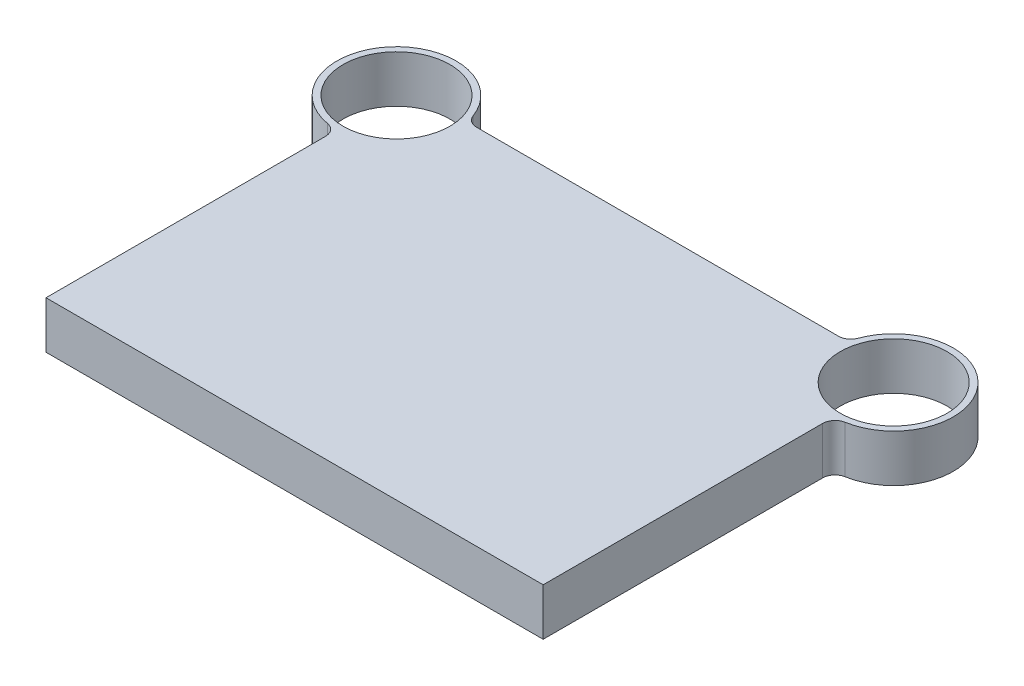
ISO-10303-21;
HEADER;
FILE_DESCRIPTION(('STEP AP214'),'2;1');
FILE_NAME('part.step','',(''),(''),'','','');
FILE_SCHEMA(('AUTOMOTIVE_DESIGN { 1 0 10303 214 1 1 1 1 }'));
ENDSEC;
DATA;
#1=APPLICATION_CONTEXT('core data for automotive mechanical design processes');
#2=APPLICATION_PROTOCOL_DEFINITION('international standard','automotive_design',2000,#1);
#3=PRODUCT_CONTEXT('',#1,'mechanical');
#4=PRODUCT('Part','Part','',(#3));
#5=PRODUCT_RELATED_PRODUCT_CATEGORY('part','',(#4));
#6=PRODUCT_DEFINITION_FORMATION('','',#4);
#7=PRODUCT_DEFINITION_CONTEXT('part definition',#1,'design');
#8=PRODUCT_DEFINITION('design','',#6,#7);
#9=PRODUCT_DEFINITION_SHAPE('','',#8);
#10=(LENGTH_UNIT() NAMED_UNIT(*) SI_UNIT(.MILLI.,.METRE.));
#11=(NAMED_UNIT(*) PLANE_ANGLE_UNIT() SI_UNIT($,.RADIAN.));
#12=(NAMED_UNIT(*) SI_UNIT($,.STERADIAN.) SOLID_ANGLE_UNIT());
#13=UNCERTAINTY_MEASURE_WITH_UNIT(LENGTH_MEASURE(1.E-05),#10,'distance_accuracy_value','');
#14=(GEOMETRIC_REPRESENTATION_CONTEXT(3) GLOBAL_UNCERTAINTY_ASSIGNED_CONTEXT((#13)) GLOBAL_UNIT_ASSIGNED_CONTEXT((#10,
#11,#12)) REPRESENTATION_CONTEXT('',''));
#15=CARTESIAN_POINT('',(0.,0.,0.));
#16=DIRECTION('',(0.,0.,1.));
#17=DIRECTION('',(1.,0.,0.));
#18=AXIS2_PLACEMENT_3D('',#15,#16,#17);
#19=CARTESIAN_POINT('',(-200.,38.,-282.));
#20=DIRECTION('',(0.,1.,0.));
#21=DIRECTION('',(0.,0.,1.));
#22=AXIS2_PLACEMENT_3D('',#19,#20,#21);
#23=PLANE('',#22);
#24=CARTESIAN_POINT('',(-200.,38.,-282.));
#25=DIRECTION('',(0.,1.,0.));
#26=DIRECTION('',(0.,0.,1.));
#27=AXIS2_PLACEMENT_3D('',#24,#25,#26);
#28=CIRCLE('',#27,43.);
#29=CARTESIAN_POINT('',(-200.,38.,-239.));
#30=VERTEX_POINT('',#29);
#31=EDGE_CURVE('E240',#30,#30,#28,.T.);
#32=ORIENTED_EDGE('',*,*,#31,.F.);
#33=EDGE_LOOP('',(#32));
#34=FACE_BOUND('',#33,.T.);
#35=CARTESIAN_POINT('',(-200.,38.,-282.));
#36=DIRECTION('',(0.,1.,0.));
#37=DIRECTION('',(0.,0.,1.));
#38=AXIS2_PLACEMENT_3D('',#35,#36,#37);
#39=CIRCLE('',#38,48.);
#40=CARTESIAN_POINT('',(-154.944030050815,38.,-298.551724137931));
#41=VERTEX_POINT('',#40);
#42=CARTESIAN_POINT('',(-208.275862068965,38.,-234.718818679992));
#43=VERTEX_POINT('',#42);
#44=EDGE_CURVE('E133',#41,#43,#39,.T.);
#45=ORIENTED_EDGE('',*,*,#44,.T.);
#46=CARTESIAN_POINT('',(-210.,38.,-224.868572571657));
#47=DIRECTION('',(0.,1.,0.));
#48=DIRECTION('',(0.,0.,1.));
#49=AXIS2_PLACEMENT_3D('',#46,#47,#48);
#50=CIRCLE('',#49,10.);
#51=CARTESIAN_POINT('',(-200.,38.,-224.868572571657));
#52=VERTEX_POINT('',#51);
#53=EDGE_CURVE('E11',#43,#52,#50,.F.);
#54=ORIENTED_EDGE('',*,*,#53,.T.);
#55=DIRECTION('',(0.,0.,1.));
#56=VECTOR('',#55,1.);
#57=CARTESIAN_POINT('',(-200.,38.,0.));
#58=LINE('',#57,#56);
#59=CARTESIAN_POINT('',(-200.,38.,0.));
#60=VERTEX_POINT('',#59);
#61=EDGE_CURVE('E106',#52,#60,#58,.T.);
#62=ORIENTED_EDGE('',*,*,#61,.T.);
#63=DIRECTION('',(1.,0.,0.));
#64=VECTOR('',#63,1.);
#65=CARTESIAN_POINT('',(200.,38.,0.));
#66=LINE('',#65,#64);
#67=CARTESIAN_POINT('',(200.,38.,0.));
#68=VERTEX_POINT('',#67);
#69=EDGE_CURVE('E110',#60,#68,#66,.T.);
#70=ORIENTED_EDGE('',*,*,#69,.T.);
#71=DIRECTION('',(0.,0.,-1.));
#72=VECTOR('',#71,1.);
#73=CARTESIAN_POINT('',(200.,38.,0.));
#74=LINE('',#73,#72);
#75=CARTESIAN_POINT('',(200.,38.,-224.868572571657));
#76=VERTEX_POINT('',#75);
#77=EDGE_CURVE('E123',#68,#76,#74,.T.);
#78=ORIENTED_EDGE('',*,*,#77,.T.);
#79=CARTESIAN_POINT('',(210.,38.,-224.868572571657));
#80=DIRECTION('',(0.,1.,0.));
#81=DIRECTION('',(0.,0.,1.));
#82=AXIS2_PLACEMENT_3D('',#79,#80,#81);
#83=CIRCLE('',#82,10.);
#84=CARTESIAN_POINT('',(208.275862068965,38.,-234.718818679992));
#85=VERTEX_POINT('',#84);
#86=EDGE_CURVE('E155',#76,#85,#83,.F.);
#87=ORIENTED_EDGE('',*,*,#86,.T.);
#88=CARTESIAN_POINT('',(200.,38.,-282.));
#89=DIRECTION('',(0.,1.,0.));
#90=DIRECTION('',(0.,0.,-1.));
#91=AXIS2_PLACEMENT_3D('',#88,#89,#90);
#92=CIRCLE('',#91,48.);
#93=CARTESIAN_POINT('',(154.944030050815,38.,-298.551724137931));
#94=VERTEX_POINT('',#93);
#95=EDGE_CURVE('E229',#85,#94,#92,.T.);
#96=ORIENTED_EDGE('',*,*,#95,.T.);
#97=CARTESIAN_POINT('',(145.557369644735,38.,-302.));
#98=DIRECTION('',(0.,1.,0.));
#99=DIRECTION('',(0.,0.,1.));
#100=AXIS2_PLACEMENT_3D('',#97,#98,#99);
#101=CIRCLE('',#100,10.);
#102=CARTESIAN_POINT('',(145.557369644735,38.,-292.));
#103=VERTEX_POINT('',#102);
#104=EDGE_CURVE('E159',#94,#103,#101,.F.);
#105=ORIENTED_EDGE('',*,*,#104,.T.);
#106=DIRECTION('',(-1.,0.,0.));
#107=VECTOR('',#106,1.);
#108=CARTESIAN_POINT('',(153.053221622778,38.,-292.));
#109=LINE('',#108,#107);
#110=CARTESIAN_POINT('',(-145.557369644735,38.,-292.));
#111=VERTEX_POINT('',#110);
#112=EDGE_CURVE('E226',#103,#111,#109,.T.);
#113=ORIENTED_EDGE('',*,*,#112,.T.);
#114=CARTESIAN_POINT('',(-145.557369644735,38.,-302.));
#115=DIRECTION('',(0.,1.,0.));
#116=DIRECTION('',(0.,0.,1.));
#117=AXIS2_PLACEMENT_3D('',#114,#115,#116);
#118=CIRCLE('',#117,10.);
#119=EDGE_CURVE('E163',#111,#41,#118,.F.);
#120=ORIENTED_EDGE('',*,*,#119,.T.);
#121=EDGE_LOOP('',(#45,#54,#62,#70,#78,#87,#96,#105,#113,#120));
#122=FACE_BOUND('',#121,.T.);
#123=CARTESIAN_POINT('',(200.,38.,-282.));
#124=DIRECTION('',(0.,1.,0.));
#125=DIRECTION('',(0.,0.,-1.));
#126=AXIS2_PLACEMENT_3D('',#123,#124,#125);
#127=CIRCLE('',#126,43.);
#128=CARTESIAN_POINT('',(200.,38.,-325.));
#129=VERTEX_POINT('',#128);
#130=EDGE_CURVE('E257',#129,#129,#127,.T.);
#131=ORIENTED_EDGE('',*,*,#130,.F.);
#132=EDGE_LOOP('',(#131));
#133=FACE_BOUND('',#132,.T.);
#134=ADVANCED_FACE('F33',(#34,#122,#133),#23,.T.);
#135=CARTESIAN_POINT('',(-200.,0.,-282.));
#136=DIRECTION('',(0.,1.,0.));
#137=DIRECTION('',(0.,0.,1.));
#138=AXIS2_PLACEMENT_3D('',#135,#136,#137);
#139=PLANE('',#138);
#140=DIRECTION('',(0.,0.,1.));
#141=VECTOR('',#140,1.);
#142=CARTESIAN_POINT('',(-200.,0.,0.));
#143=LINE('',#142,#141);
#144=CARTESIAN_POINT('',(-200.,0.,-224.868572571657));
#145=VERTEX_POINT('',#144);
#146=CARTESIAN_POINT('',(-200.,0.,0.));
#147=VERTEX_POINT('',#146);
#148=EDGE_CURVE('E127',#145,#147,#143,.T.);
#149=ORIENTED_EDGE('',*,*,#148,.F.);
#150=CARTESIAN_POINT('',(-210.,0.,-224.868572571657));
#151=DIRECTION('',(0.,1.,0.));
#152=DIRECTION('',(0.,0.,1.));
#153=AXIS2_PLACEMENT_3D('',#150,#151,#152);
#154=CIRCLE('',#153,10.);
#155=CARTESIAN_POINT('',(-208.275862068965,0.,-234.718818679992));
#156=VERTEX_POINT('',#155);
#157=EDGE_CURVE('E41',#145,#156,#154,.T.);
#158=ORIENTED_EDGE('',*,*,#157,.T.);
#159=CARTESIAN_POINT('',(-200.,0.,-282.));
#160=DIRECTION('',(0.,1.,0.));
#161=DIRECTION('',(0.,0.,1.));
#162=AXIS2_PLACEMENT_3D('',#159,#160,#161);
#163=CIRCLE('',#162,48.);
#164=CARTESIAN_POINT('',(-154.944030050815,0.,-298.551724137931));
#165=VERTEX_POINT('',#164);
#166=EDGE_CURVE('E114',#165,#156,#163,.T.);
#167=ORIENTED_EDGE('',*,*,#166,.F.);
#168=CARTESIAN_POINT('',(-145.557369644735,0.,-302.));
#169=DIRECTION('',(0.,1.,0.));
#170=DIRECTION('',(0.,0.,1.));
#171=AXIS2_PLACEMENT_3D('',#168,#169,#170);
#172=CIRCLE('',#171,10.);
#173=CARTESIAN_POINT('',(-145.557369644735,0.,-292.));
#174=VERTEX_POINT('',#173);
#175=EDGE_CURVE('E161',#165,#174,#172,.T.);
#176=ORIENTED_EDGE('',*,*,#175,.T.);
#177=DIRECTION('',(-1.,0.,0.));
#178=VECTOR('',#177,1.);
#179=CARTESIAN_POINT('',(153.053221622778,0.,-292.));
#180=LINE('',#179,#178);
#181=CARTESIAN_POINT('',(145.557369644735,0.,-292.));
#182=VERTEX_POINT('',#181);
#183=EDGE_CURVE('E173',#182,#174,#180,.T.);
#184=ORIENTED_EDGE('',*,*,#183,.F.);
#185=CARTESIAN_POINT('',(145.557369644735,0.,-302.));
#186=DIRECTION('',(0.,1.,0.));
#187=DIRECTION('',(0.,0.,1.));
#188=AXIS2_PLACEMENT_3D('',#185,#186,#187);
#189=CIRCLE('',#188,10.);
#190=CARTESIAN_POINT('',(154.944030050815,0.,-298.551724137931));
#191=VERTEX_POINT('',#190);
#192=EDGE_CURVE('E157',#182,#191,#189,.T.);
#193=ORIENTED_EDGE('',*,*,#192,.T.);
#194=CARTESIAN_POINT('',(200.,0.,-282.));
#195=DIRECTION('',(0.,1.,0.));
#196=DIRECTION('',(0.,0.,-1.));
#197=AXIS2_PLACEMENT_3D('',#194,#195,#196);
#198=CIRCLE('',#197,48.);
#199=CARTESIAN_POINT('',(208.275862068965,0.,-234.718818679992));
#200=VERTEX_POINT('',#199);
#201=EDGE_CURVE('E245',#200,#191,#198,.T.);
#202=ORIENTED_EDGE('',*,*,#201,.F.);
#203=CARTESIAN_POINT('',(210.,0.,-224.868572571657));
#204=DIRECTION('',(0.,1.,0.));
#205=DIRECTION('',(0.,0.,1.));
#206=AXIS2_PLACEMENT_3D('',#203,#204,#205);
#207=CIRCLE('',#206,10.);
#208=CARTESIAN_POINT('',(200.,0.,-224.868572571657));
#209=VERTEX_POINT('',#208);
#210=EDGE_CURVE('E153',#200,#209,#207,.T.);
#211=ORIENTED_EDGE('',*,*,#210,.T.);
#212=DIRECTION('',(0.,0.,-1.));
#213=VECTOR('',#212,1.);
#214=CARTESIAN_POINT('',(200.,0.,0.));
#215=LINE('',#214,#213);
#216=CARTESIAN_POINT('',(200.,0.,0.));
#217=VERTEX_POINT('',#216);
#218=EDGE_CURVE('E242',#217,#209,#215,.T.);
#219=ORIENTED_EDGE('',*,*,#218,.F.);
#220=DIRECTION('',(1.,0.,0.));
#221=VECTOR('',#220,1.);
#222=CARTESIAN_POINT('',(200.,0.,0.));
#223=LINE('',#222,#221);
#224=EDGE_CURVE('E239',#147,#217,#223,.T.);
#225=ORIENTED_EDGE('',*,*,#224,.F.);
#226=EDGE_LOOP('',(#149,#158,#167,#176,#184,#193,#202,#211,#219,#225));
#227=FACE_BOUND('',#226,.T.);
#228=CARTESIAN_POINT('',(-200.,0.,-282.));
#229=DIRECTION('',(0.,1.,0.));
#230=DIRECTION('',(0.,0.,1.));
#231=AXIS2_PLACEMENT_3D('',#228,#229,#230);
#232=CIRCLE('',#231,43.);
#233=CARTESIAN_POINT('',(-200.,0.,-239.));
#234=VERTEX_POINT('',#233);
#235=EDGE_CURVE('E254',#234,#234,#232,.T.);
#236=ORIENTED_EDGE('',*,*,#235,.T.);
#237=EDGE_LOOP('',(#236));
#238=FACE_BOUND('',#237,.T.);
#239=CARTESIAN_POINT('',(200.,0.,-282.));
#240=DIRECTION('',(0.,1.,0.));
#241=DIRECTION('',(0.,0.,-1.));
#242=AXIS2_PLACEMENT_3D('',#239,#240,#241);
#243=CIRCLE('',#242,43.);
#244=CARTESIAN_POINT('',(200.,0.,-325.));
#245=VERTEX_POINT('',#244);
#246=EDGE_CURVE('E260',#245,#245,#243,.T.);
#247=ORIENTED_EDGE('',*,*,#246,.T.);
#248=EDGE_LOOP('',(#247));
#249=FACE_BOUND('',#248,.T.);
#250=ADVANCED_FACE('F167',(#227,#238,#249),#139,.F.);
#251=CARTESIAN_POINT('',(-200.,38.,0.));
#252=DIRECTION('',(1.,0.,0.));
#253=DIRECTION('',(0.,0.,-1.));
#254=AXIS2_PLACEMENT_3D('',#251,#252,#253);
#255=PLANE('',#254);
#256=ORIENTED_EDGE('',*,*,#61,.F.);
#257=DIRECTION('',(0.,1.,0.));
#258=VECTOR('',#257,1.);
#259=CARTESIAN_POINT('',(-200.,0.,-224.868572571657));
#260=LINE('',#259,#258);
#261=EDGE_CURVE('E151',#52,#145,#260,.F.);
#262=ORIENTED_EDGE('',*,*,#261,.T.);
#263=ORIENTED_EDGE('',*,*,#148,.T.);
#264=DIRECTION('',(0.,-1.,0.));
#265=VECTOR('',#264,1.);
#266=CARTESIAN_POINT('',(-200.,38.,0.));
#267=LINE('',#266,#265);
#268=EDGE_CURVE('E119',#60,#147,#267,.T.);
#269=ORIENTED_EDGE('',*,*,#268,.F.);
#270=EDGE_LOOP('',(#256,#262,#263,#269));
#271=FACE_BOUND('',#270,.T.);
#272=ADVANCED_FACE('F125',(#271),#255,.F.);
#273=CARTESIAN_POINT('',(200.,38.,0.));
#274=DIRECTION('',(0.,0.,-1.));
#275=DIRECTION('',(-1.,0.,0.));
#276=AXIS2_PLACEMENT_3D('',#273,#274,#275);
#277=PLANE('',#276);
#278=ORIENTED_EDGE('',*,*,#224,.T.);
#279=DIRECTION('',(0.,-1.,0.));
#280=VECTOR('',#279,1.);
#281=CARTESIAN_POINT('',(200.,38.,0.));
#282=LINE('',#281,#280);
#283=EDGE_CURVE('E121',#68,#217,#282,.T.);
#284=ORIENTED_EDGE('',*,*,#283,.F.);
#285=ORIENTED_EDGE('',*,*,#69,.F.);
#286=ORIENTED_EDGE('',*,*,#268,.T.);
#287=EDGE_LOOP('',(#278,#284,#285,#286));
#288=FACE_BOUND('',#287,.T.);
#289=ADVANCED_FACE('F118',(#288),#277,.F.);
#290=CARTESIAN_POINT('',(200.,38.,0.));
#291=DIRECTION('',(-1.,0.,0.));
#292=DIRECTION('',(0.,0.,1.));
#293=AXIS2_PLACEMENT_3D('',#290,#291,#292);
#294=PLANE('',#293);
#295=ORIENTED_EDGE('',*,*,#218,.T.);
#296=DIRECTION('',(0.,1.,0.));
#297=VECTOR('',#296,1.);
#298=CARTESIAN_POINT('',(200.,38.,-224.868572571657));
#299=LINE('',#298,#297);
#300=EDGE_CURVE('E139',#209,#76,#299,.T.);
#301=ORIENTED_EDGE('',*,*,#300,.T.);
#302=ORIENTED_EDGE('',*,*,#77,.F.);
#303=ORIENTED_EDGE('',*,*,#283,.T.);
#304=EDGE_LOOP('',(#295,#301,#302,#303));
#305=FACE_BOUND('',#304,.T.);
#306=ADVANCED_FACE('F202',(#305),#294,.F.);
#307=CARTESIAN_POINT('',(200.,38.,-282.));
#308=DIRECTION('',(0.,-1.,0.));
#309=DIRECTION('',(0.,0.,-1.));
#310=AXIS2_PLACEMENT_3D('',#307,#308,#309);
#311=CYLINDRICAL_SURFACE('',#310,48.);
#312=ORIENTED_EDGE('',*,*,#95,.F.);
#313=DIRECTION('',(0.,-1.,0.));
#314=VECTOR('',#313,1.);
#315=CARTESIAN_POINT('',(208.275862068965,38.,-234.718818679992));
#316=LINE('',#315,#314);
#317=EDGE_CURVE('E131',#85,#200,#316,.T.);
#318=ORIENTED_EDGE('',*,*,#317,.T.);
#319=ORIENTED_EDGE('',*,*,#201,.T.);
#320=DIRECTION('',(0.,-1.,0.));
#321=VECTOR('',#320,1.);
#322=CARTESIAN_POINT('',(154.944030050815,38.,-298.551724137931));
#323=LINE('',#322,#321);
#324=EDGE_CURVE('E129',#191,#94,#323,.F.);
#325=ORIENTED_EDGE('',*,*,#324,.T.);
#326=EDGE_LOOP('',(#312,#318,#319,#325));
#327=FACE_BOUND('',#326,.T.);
#328=ADVANCED_FACE('F198',(#327),#311,.T.);
#329=CARTESIAN_POINT('',(153.053221622778,38.,-292.));
#330=DIRECTION('',(0.,0.,1.));
#331=DIRECTION('',(1.,0.,0.));
#332=AXIS2_PLACEMENT_3D('',#329,#330,#331);
#333=PLANE('',#332);
#334=ORIENTED_EDGE('',*,*,#112,.F.);
#335=DIRECTION('',(0.,1.,0.));
#336=VECTOR('',#335,1.);
#337=CARTESIAN_POINT('',(145.557369644735,0.,-292.));
#338=LINE('',#337,#336);
#339=EDGE_CURVE('E143',#103,#182,#338,.F.);
#340=ORIENTED_EDGE('',*,*,#339,.T.);
#341=ORIENTED_EDGE('',*,*,#183,.T.);
#342=DIRECTION('',(0.,1.,0.));
#343=VECTOR('',#342,1.);
#344=CARTESIAN_POINT('',(-145.557369644735,38.,-292.));
#345=LINE('',#344,#343);
#346=EDGE_CURVE('E141',#174,#111,#345,.T.);
#347=ORIENTED_EDGE('',*,*,#346,.T.);
#348=EDGE_LOOP('',(#334,#340,#341,#347));
#349=FACE_BOUND('',#348,.T.);
#350=ADVANCED_FACE('F195',(#349),#333,.F.);
#351=CARTESIAN_POINT('',(-200.,38.,-282.));
#352=DIRECTION('',(0.,-1.,0.));
#353=DIRECTION('',(0.,0.,-1.));
#354=AXIS2_PLACEMENT_3D('',#351,#352,#353);
#355=CYLINDRICAL_SURFACE('',#354,48.);
#356=ORIENTED_EDGE('',*,*,#44,.F.);
#357=DIRECTION('',(0.,-1.,0.));
#358=VECTOR('',#357,1.);
#359=CARTESIAN_POINT('',(-154.944030050815,38.,-298.551724137931));
#360=LINE('',#359,#358);
#361=EDGE_CURVE('E148',#41,#165,#360,.T.);
#362=ORIENTED_EDGE('',*,*,#361,.T.);
#363=ORIENTED_EDGE('',*,*,#166,.T.);
#364=DIRECTION('',(0.,-1.,0.));
#365=VECTOR('',#364,1.);
#366=CARTESIAN_POINT('',(-208.275862068965,38.,-234.718818679992));
#367=LINE('',#366,#365);
#368=EDGE_CURVE('E146',#156,#43,#367,.F.);
#369=ORIENTED_EDGE('',*,*,#368,.T.);
#370=EDGE_LOOP('',(#356,#362,#363,#369));
#371=FACE_BOUND('',#370,.T.);
#372=ADVANCED_FACE('F171',(#371),#355,.T.);
#373=CARTESIAN_POINT('',(-200.,38.,-282.));
#374=DIRECTION('',(0.,-1.,0.));
#375=DIRECTION('',(0.,0.,-1.));
#376=AXIS2_PLACEMENT_3D('',#373,#374,#375);
#377=CYLINDRICAL_SURFACE('',#376,43.);
#378=ORIENTED_EDGE('',*,*,#31,.T.);
#379=EDGE_LOOP('',(#378));
#380=FACE_BOUND('',#379,.T.);
#381=ORIENTED_EDGE('',*,*,#235,.F.);
#382=EDGE_LOOP('',(#381));
#383=FACE_BOUND('',#382,.T.);
#384=ADVANCED_FACE('F190',(#380,#383),#377,.F.);
#385=CARTESIAN_POINT('',(200.,38.,-282.));
#386=DIRECTION('',(0.,-1.,0.));
#387=DIRECTION('',(0.,0.,-1.));
#388=AXIS2_PLACEMENT_3D('',#385,#386,#387);
#389=CYLINDRICAL_SURFACE('',#388,43.);
#390=ORIENTED_EDGE('',*,*,#130,.T.);
#391=EDGE_LOOP('',(#390));
#392=FACE_BOUND('',#391,.T.);
#393=ORIENTED_EDGE('',*,*,#246,.F.);
#394=EDGE_LOOP('',(#393));
#395=FACE_BOUND('',#394,.T.);
#396=ADVANCED_FACE('F214',(#392,#395),#389,.F.);
#397=CARTESIAN_POINT('',(210.,38.,-224.868572571657));
#398=DIRECTION('',(0.,-1.,0.));
#399=DIRECTION('',(0.,0.,-1.));
#400=AXIS2_PLACEMENT_3D('',#397,#398,#399);
#401=CYLINDRICAL_SURFACE('',#400,10.);
#402=ORIENTED_EDGE('',*,*,#86,.F.);
#403=ORIENTED_EDGE('',*,*,#300,.F.);
#404=ORIENTED_EDGE('',*,*,#210,.F.);
#405=ORIENTED_EDGE('',*,*,#317,.F.);
#406=EDGE_LOOP('',(#402,#403,#404,#405));
#407=FACE_BOUND('',#406,.T.);
#408=ADVANCED_FACE('F211',(#407),#401,.F.);
#409=CARTESIAN_POINT('',(145.557369644735,38.,-302.));
#410=DIRECTION('',(0.,-1.,0.));
#411=DIRECTION('',(0.,0.,-1.));
#412=AXIS2_PLACEMENT_3D('',#409,#410,#411);
#413=CYLINDRICAL_SURFACE('',#412,10.);
#414=ORIENTED_EDGE('',*,*,#104,.F.);
#415=ORIENTED_EDGE('',*,*,#324,.F.);
#416=ORIENTED_EDGE('',*,*,#192,.F.);
#417=ORIENTED_EDGE('',*,*,#339,.F.);
#418=EDGE_LOOP('',(#414,#415,#416,#417));
#419=FACE_BOUND('',#418,.T.);
#420=ADVANCED_FACE('F179',(#419),#413,.F.);
#421=CARTESIAN_POINT('',(-145.557369644735,38.,-302.));
#422=DIRECTION('',(0.,-1.,0.));
#423=DIRECTION('',(0.,0.,-1.));
#424=AXIS2_PLACEMENT_3D('',#421,#422,#423);
#425=CYLINDRICAL_SURFACE('',#424,10.);
#426=ORIENTED_EDGE('',*,*,#119,.F.);
#427=ORIENTED_EDGE('',*,*,#346,.F.);
#428=ORIENTED_EDGE('',*,*,#175,.F.);
#429=ORIENTED_EDGE('',*,*,#361,.F.);
#430=EDGE_LOOP('',(#426,#427,#428,#429));
#431=FACE_BOUND('',#430,.T.);
#432=ADVANCED_FACE('F175',(#431),#425,.F.);
#433=CARTESIAN_POINT('',(-210.,38.,-224.868572571657));
#434=DIRECTION('',(0.,-1.,0.));
#435=DIRECTION('',(0.,0.,-1.));
#436=AXIS2_PLACEMENT_3D('',#433,#434,#435);
#437=CYLINDRICAL_SURFACE('',#436,10.);
#438=ORIENTED_EDGE('',*,*,#53,.F.);
#439=ORIENTED_EDGE('',*,*,#368,.F.);
#440=ORIENTED_EDGE('',*,*,#157,.F.);
#441=ORIENTED_EDGE('',*,*,#261,.F.);
#442=EDGE_LOOP('',(#438,#439,#440,#441));
#443=FACE_BOUND('',#442,.T.);
#444=ADVANCED_FACE('F35',(#443),#437,.F.);
#445=CLOSED_SHELL('',(#134,#250,#272,#289,#306,#328,#350,#372,#384,#396,#408,#420,#432,#444));
#446=MANIFOLD_SOLID_BREP('B2',#445);
#447=ADVANCED_BREP_SHAPE_REPRESENTATION('',(#18,#446),#14);
#448=SHAPE_DEFINITION_REPRESENTATION(#9,#447);
ENDSEC;
END-ISO-10303-21;
